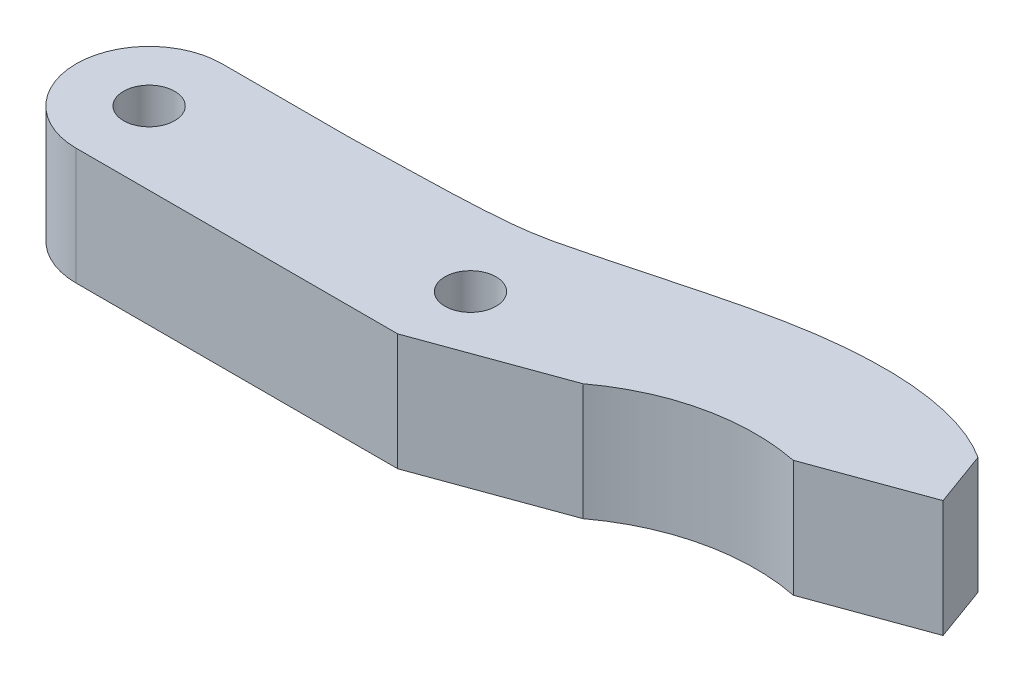
ISO-10303-21;
HEADER;
FILE_DESCRIPTION(('STEP AP214'),'2;1');
FILE_NAME('part.step','',(''),(''),'','','');
FILE_SCHEMA(('AUTOMOTIVE_DESIGN { 1 0 10303 214 1 1 1 1 }'));
ENDSEC;
DATA;
#1=APPLICATION_CONTEXT('core data for automotive mechanical design processes');
#2=APPLICATION_PROTOCOL_DEFINITION('international standard','automotive_design',2000,#1);
#3=PRODUCT_CONTEXT('',#1,'mechanical');
#4=PRODUCT('Part','Part','',(#3));
#5=PRODUCT_RELATED_PRODUCT_CATEGORY('part','',(#4));
#6=PRODUCT_DEFINITION_FORMATION('','',#4);
#7=PRODUCT_DEFINITION_CONTEXT('part definition',#1,'design');
#8=PRODUCT_DEFINITION('design','',#6,#7);
#9=PRODUCT_DEFINITION_SHAPE('','',#8);
#10=(LENGTH_UNIT() NAMED_UNIT(*) SI_UNIT(.MILLI.,.METRE.));
#11=(NAMED_UNIT(*) PLANE_ANGLE_UNIT() SI_UNIT($,.RADIAN.));
#12=(NAMED_UNIT(*) SI_UNIT($,.STERADIAN.) SOLID_ANGLE_UNIT());
#13=UNCERTAINTY_MEASURE_WITH_UNIT(LENGTH_MEASURE(1.E-05),#10,'distance_accuracy_value','');
#14=(GEOMETRIC_REPRESENTATION_CONTEXT(3) GLOBAL_UNCERTAINTY_ASSIGNED_CONTEXT((#13)) GLOBAL_UNIT_ASSIGNED_CONTEXT((#10,
#11,#12)) REPRESENTATION_CONTEXT('',''));
#15=CARTESIAN_POINT('',(0.,0.,0.));
#16=DIRECTION('',(0.,0.,1.));
#17=DIRECTION('',(1.,0.,0.));
#18=AXIS2_PLACEMENT_3D('',#15,#16,#17);
#19=CARTESIAN_POINT('',(0.,8.,0.));
#20=DIRECTION('',(0.,1.,0.));
#21=DIRECTION('',(0.,0.,1.));
#22=AXIS2_PLACEMENT_3D('',#19,#20,#21);
#23=PLANE('',#22);
#24=CARTESIAN_POINT('',(0.,8.,0.));
#25=DIRECTION('',(0.,1.,0.));
#26=DIRECTION('',(0.,0.,1.));
#27=AXIS2_PLACEMENT_3D('',#24,#25,#26);
#28=CIRCLE('',#27,1.75);
#29=CARTESIAN_POINT('',(0.,8.,1.75));
#30=VERTEX_POINT('',#29);
#31=EDGE_CURVE('E192',#30,#30,#28,.T.);
#32=ORIENTED_EDGE('',*,*,#31,.F.);
#33=EDGE_LOOP('',(#32));
#34=FACE_BOUND('',#33,.T.);
#35=CARTESIAN_POINT('',(0.,8.,0.));
#36=DIRECTION('',(0.,1.,0.));
#37=DIRECTION('',(0.,0.,1.));
#38=AXIS2_PLACEMENT_3D('',#35,#36,#37);
#39=CIRCLE('',#38,5.);
#40=CARTESIAN_POINT('',(0.,8.,-5.));
#41=VERTEX_POINT('',#40);
#42=CARTESIAN_POINT('',(0.,8.,5.));
#43=VERTEX_POINT('',#42);
#44=EDGE_CURVE('E198',#41,#43,#39,.T.);
#45=ORIENTED_EDGE('',*,*,#44,.T.);
#46=DIRECTION('',(1.,0.,0.));
#47=VECTOR('',#46,1.);
#48=CARTESIAN_POINT('',(0.,8.,5.));
#49=LINE('',#48,#47);
#50=CARTESIAN_POINT('',(22.0154718075747,8.,5.));
#51=VERTEX_POINT('',#50);
#52=EDGE_CURVE('E93',#43,#51,#49,.T.);
#53=ORIENTED_EDGE('',*,*,#52,.T.);
#54=DIRECTION('',(0.939692620785908,0.,-0.34202014332567));
#55=VECTOR('',#54,1.);
#56=CARTESIAN_POINT('',(22.0154718075747,8.,5.));
#57=LINE('',#56,#55);
#58=CARTESIAN_POINT('',(31.3184287533552,8.,1.61400058107586));
#59=VERTEX_POINT('',#58);
#60=EDGE_CURVE('E201',#51,#59,#57,.T.);
#61=ORIENTED_EDGE('',*,*,#60,.T.);
#62=CARTESIAN_POINT('',(40.1742925465507,8.,13.4719696644037));
#63=DIRECTION('',(0.,-1.,0.));
#64=DIRECTION('',(0.,0.,-1.));
#65=AXIS2_PLACEMENT_3D('',#62,#63,#64);
#66=CIRCLE('',#65,14.7999241317241);
#67=CARTESIAN_POINT('',(43.0521943321293,8.,-1.04544868795335));
#68=VERTEX_POINT('',#67);
#69=EDGE_CURVE('E203',#59,#68,#66,.T.);
#70=ORIENTED_EDGE('',*,*,#69,.T.);
#71=DIRECTION('',(0.939692620785908,0.,-0.34202014332567));
#72=VECTOR('',#71,1.);
#73=CARTESIAN_POINT('',(43.0521943321293,8.,-1.04544868795335));
#74=LINE('',#73,#72);
#75=CARTESIAN_POINT('',(50.5697352984166,8.,-3.78160983455871));
#76=VERTEX_POINT('',#75);
#77=EDGE_CURVE('E112',#68,#76,#74,.T.);
#78=ORIENTED_EDGE('',*,*,#77,.T.);
#79=DIRECTION('',(-0.342020143325669,0.,-0.939692620785908));
#80=VECTOR('',#79,1.);
#81=CARTESIAN_POINT('',(50.5697352984166,8.,-3.78160983455871));
#82=LINE('',#81,#80);
#83=CARTESIAN_POINT('',(49.2016547251139,8.,-7.54038031770234));
#84=VERTEX_POINT('',#83);
#85=EDGE_CURVE('E106',#76,#84,#82,.T.);
#86=ORIENTED_EDGE('',*,*,#85,.T.);
#87=CARTESIAN_POINT('',(49.201654725114,8.,-7.54038031770231));
#88=CARTESIAN_POINT('',(46.2595057479489,8.,-9.44154741661983));
#89=CARTESIAN_POINT('',(40.8783588109812,8.,-10.315839720437));
#90=CARTESIAN_POINT('',(30.5663362877365,8.,-8.16520332360282));
#91=CARTESIAN_POINT('',(26.7015982142515,8.,-6.99026183960731));
#92=CARTESIAN_POINT('',(19.0153320272197,8.,-5.1134109408604));
#93=CARTESIAN_POINT('',(11.831247013395,8.,-5.11325248850904));
#94=CARTESIAN_POINT('',(8.7,8.,-5.));
#95=B_SPLINE_CURVE_WITH_KNOTS('',3,(#87,#88,#89,#90,#91,#92,#93,#94),.UNSPECIFIED.,.F.,.F.,(4,1,
1,1,1,4),(0.,0.522941519191293,0.610638691715125,0.847379165957973,0.889274552714496,1.),.UNSPECIFIED.);
#96=CARTESIAN_POINT('',(8.7,8.,-5.));
#97=VERTEX_POINT('',#96);
#98=EDGE_CURVE('E110',#84,#97,#95,.T.);
#99=ORIENTED_EDGE('',*,*,#98,.T.);
#100=DIRECTION('',(-1.,0.,0.));
#101=VECTOR('',#100,1.);
#102=CARTESIAN_POINT('',(0.,8.,-5.));
#103=LINE('',#102,#101);
#104=EDGE_CURVE('E50',#97,#41,#103,.T.);
#105=ORIENTED_EDGE('',*,*,#104,.T.);
#106=EDGE_LOOP('',(#45,#53,#61,#70,#78,#86,#99,#105));
#107=FACE_BOUND('',#106,.T.);
#108=CARTESIAN_POINT('',(22.,8.,0.));
#109=DIRECTION('',(0.,1.,0.));
#110=DIRECTION('',(0.,0.,1.));
#111=AXIS2_PLACEMENT_3D('',#108,#109,#110);
#112=CIRCLE('',#111,1.75);
#113=CARTESIAN_POINT('',(22.,8.,1.75));
#114=VERTEX_POINT('',#113);
#115=EDGE_CURVE('E183',#114,#114,#112,.T.);
#116=ORIENTED_EDGE('',*,*,#115,.F.);
#117=EDGE_LOOP('',(#116));
#118=FACE_BOUND('',#117,.T.);
#119=ADVANCED_FACE('F33',(#34,#107,#118),#23,.T.);
#120=CARTESIAN_POINT('',(0.,0.,0.));
#121=DIRECTION('',(0.,1.,0.));
#122=DIRECTION('',(0.,0.,1.));
#123=AXIS2_PLACEMENT_3D('',#120,#121,#122);
#124=PLANE('',#123);
#125=CARTESIAN_POINT('',(0.,0.,0.));
#126=DIRECTION('',(0.,1.,0.));
#127=DIRECTION('',(0.,0.,1.));
#128=AXIS2_PLACEMENT_3D('',#125,#126,#127);
#129=CIRCLE('',#128,1.75);
#130=CARTESIAN_POINT('',(0.,0.,1.75));
#131=VERTEX_POINT('',#130);
#132=EDGE_CURVE('E189',#131,#131,#129,.T.);
#133=ORIENTED_EDGE('',*,*,#132,.T.);
#134=EDGE_LOOP('',(#133));
#135=FACE_BOUND('',#134,.T.);
#136=CARTESIAN_POINT('',(0.,0.,0.));
#137=DIRECTION('',(0.,1.,0.));
#138=DIRECTION('',(0.,0.,1.));
#139=AXIS2_PLACEMENT_3D('',#136,#137,#138);
#140=CIRCLE('',#139,5.);
#141=CARTESIAN_POINT('',(0.,0.,-5.));
#142=VERTEX_POINT('',#141);
#143=CARTESIAN_POINT('',(0.,0.,5.));
#144=VERTEX_POINT('',#143);
#145=EDGE_CURVE('E195',#142,#144,#140,.T.);
#146=ORIENTED_EDGE('',*,*,#145,.F.);
#147=DIRECTION('',(-1.,0.,0.));
#148=VECTOR('',#147,1.);
#149=CARTESIAN_POINT('',(0.,0.,-5.));
#150=LINE('',#149,#148);
#151=CARTESIAN_POINT('',(8.7,0.,-5.));
#152=VERTEX_POINT('',#151);
#153=EDGE_CURVE('E85',#152,#142,#150,.T.);
#154=ORIENTED_EDGE('',*,*,#153,.F.);
#155=CARTESIAN_POINT('',(49.201654725114,0.,-7.54038031770231));
#156=CARTESIAN_POINT('',(46.2595057479489,0.,-9.44154741661983));
#157=CARTESIAN_POINT('',(40.8783588109812,0.,-10.315839720437));
#158=CARTESIAN_POINT('',(30.5663362877365,0.,-8.16520332360282));
#159=CARTESIAN_POINT('',(26.7015982142515,0.,-6.99026183960731));
#160=CARTESIAN_POINT('',(19.0153320272197,0.,-5.1134109408604));
#161=CARTESIAN_POINT('',(11.831247013395,0.,-5.11325248850904));
#162=CARTESIAN_POINT('',(8.7,0.,-5.));
#163=B_SPLINE_CURVE_WITH_KNOTS('',3,(#155,#156,#157,#158,#159,#160,#161,#162),.UNSPECIFIED.,.F.,
.F.,(4,1,1,1,1,4),(0.,0.522941519191293,0.610638691715125,0.847379165957973,0.889274552714496,
1.),.UNSPECIFIED.);
#164=CARTESIAN_POINT('',(49.2016547251139,0.,-7.54038031770234));
#165=VERTEX_POINT('',#164);
#166=EDGE_CURVE('E79',#165,#152,#163,.T.);
#167=ORIENTED_EDGE('',*,*,#166,.F.);
#168=DIRECTION('',(-0.342020143325669,0.,-0.939692620785908));
#169=VECTOR('',#168,1.);
#170=CARTESIAN_POINT('',(50.5697352984166,0.,-3.78160983455871));
#171=LINE('',#170,#169);
#172=CARTESIAN_POINT('',(50.5697352984166,0.,-3.78160983455871));
#173=VERTEX_POINT('',#172);
#174=EDGE_CURVE('E120',#173,#165,#171,.T.);
#175=ORIENTED_EDGE('',*,*,#174,.F.);
#176=DIRECTION('',(0.939692620785908,0.,-0.34202014332567));
#177=VECTOR('',#176,1.);
#178=CARTESIAN_POINT('',(43.0521943321293,0.,-1.04544868795335));
#179=LINE('',#178,#177);
#180=CARTESIAN_POINT('',(43.0521943321293,0.,-1.04544868795335));
#181=VERTEX_POINT('',#180);
#182=EDGE_CURVE('E216',#181,#173,#179,.T.);
#183=ORIENTED_EDGE('',*,*,#182,.F.);
#184=CARTESIAN_POINT('',(40.1742925465507,0.,13.4719696644037));
#185=DIRECTION('',(0.,-1.,0.));
#186=DIRECTION('',(0.,0.,-1.));
#187=AXIS2_PLACEMENT_3D('',#184,#185,#186);
#188=CIRCLE('',#187,14.7999241317241);
#189=CARTESIAN_POINT('',(31.3184287533552,0.,1.61400058107586));
#190=VERTEX_POINT('',#189);
#191=EDGE_CURVE('E212',#190,#181,#188,.T.);
#192=ORIENTED_EDGE('',*,*,#191,.F.);
#193=DIRECTION('',(0.939692620785908,0.,-0.34202014332567));
#194=VECTOR('',#193,1.);
#195=CARTESIAN_POINT('',(22.0154718075747,0.,5.));
#196=LINE('',#195,#194);
#197=CARTESIAN_POINT('',(22.0154718075747,0.,5.));
#198=VERTEX_POINT('',#197);
#199=EDGE_CURVE('E222',#198,#190,#196,.T.);
#200=ORIENTED_EDGE('',*,*,#199,.F.);
#201=DIRECTION('',(1.,0.,0.));
#202=VECTOR('',#201,1.);
#203=CARTESIAN_POINT('',(0.,0.,5.));
#204=LINE('',#203,#202);
#205=EDGE_CURVE('E225',#144,#198,#204,.T.);
#206=ORIENTED_EDGE('',*,*,#205,.F.);
#207=EDGE_LOOP('',(#146,#154,#167,#175,#183,#192,#200,#206));
#208=FACE_BOUND('',#207,.T.);
#209=CARTESIAN_POINT('',(22.,0.,0.));
#210=DIRECTION('',(0.,1.,0.));
#211=DIRECTION('',(0.,0.,1.));
#212=AXIS2_PLACEMENT_3D('',#209,#210,#211);
#213=CIRCLE('',#212,1.75);
#214=CARTESIAN_POINT('',(22.,0.,1.75));
#215=VERTEX_POINT('',#214);
#216=EDGE_CURVE('E186',#215,#215,#213,.T.);
#217=ORIENTED_EDGE('',*,*,#216,.T.);
#218=EDGE_LOOP('',(#217));
#219=FACE_BOUND('',#218,.T.);
#220=ADVANCED_FACE('F160',(#135,#208,#219),#124,.F.);
#221=CARTESIAN_POINT('',(0.,8.,0.));
#222=DIRECTION('',(0.,-1.,0.));
#223=DIRECTION('',(0.,0.,-1.));
#224=AXIS2_PLACEMENT_3D('',#221,#222,#223);
#225=CYLINDRICAL_SURFACE('',#224,5.);
#226=ORIENTED_EDGE('',*,*,#145,.T.);
#227=DIRECTION('',(0.,-1.,0.));
#228=VECTOR('',#227,1.);
#229=CARTESIAN_POINT('',(0.,8.,5.));
#230=LINE('',#229,#228);
#231=EDGE_CURVE('E11',#43,#144,#230,.T.);
#232=ORIENTED_EDGE('',*,*,#231,.F.);
#233=ORIENTED_EDGE('',*,*,#44,.F.);
#234=DIRECTION('',(0.,-1.,0.));
#235=VECTOR('',#234,1.);
#236=CARTESIAN_POINT('',(0.,8.,-5.));
#237=LINE('',#236,#235);
#238=EDGE_CURVE('E126',#41,#142,#237,.T.);
#239=ORIENTED_EDGE('',*,*,#238,.T.);
#240=EDGE_LOOP('',(#226,#232,#233,#239));
#241=FACE_BOUND('',#240,.T.);
#242=ADVANCED_FACE('F35',(#241),#225,.T.);
#243=CARTESIAN_POINT('',(0.,8.,5.));
#244=DIRECTION('',(0.,0.,-1.));
#245=DIRECTION('',(-1.,0.,0.));
#246=AXIS2_PLACEMENT_3D('',#243,#244,#245);
#247=PLANE('',#246);
#248=ORIENTED_EDGE('',*,*,#205,.T.);
#249=DIRECTION('',(0.,-1.,0.));
#250=VECTOR('',#249,1.);
#251=CARTESIAN_POINT('',(22.0154718075747,8.,5.));
#252=LINE('',#251,#250);
#253=EDGE_CURVE('E42',#51,#198,#252,.T.);
#254=ORIENTED_EDGE('',*,*,#253,.F.);
#255=ORIENTED_EDGE('',*,*,#52,.F.);
#256=ORIENTED_EDGE('',*,*,#231,.T.);
#257=EDGE_LOOP('',(#248,#254,#255,#256));
#258=FACE_BOUND('',#257,.T.);
#259=ADVANCED_FACE('F154',(#258),#247,.F.);
#260=CARTESIAN_POINT('',(22.0154718075747,8.,5.));
#261=DIRECTION('',(-0.34202014332567,0.,-0.939692620785908));
#262=DIRECTION('',(-0.939692620785908,0.,0.34202014332567));
#263=AXIS2_PLACEMENT_3D('',#260,#261,#262);
#264=PLANE('',#263);
#265=ORIENTED_EDGE('',*,*,#199,.T.);
#266=DIRECTION('',(0.,-1.,0.));
#267=VECTOR('',#266,1.);
#268=CARTESIAN_POINT('',(31.3184287533552,8.,1.61400058107586));
#269=LINE('',#268,#267);
#270=EDGE_CURVE('E214',#59,#190,#269,.T.);
#271=ORIENTED_EDGE('',*,*,#270,.F.);
#272=ORIENTED_EDGE('',*,*,#60,.F.);
#273=ORIENTED_EDGE('',*,*,#253,.T.);
#274=EDGE_LOOP('',(#265,#271,#272,#273));
#275=FACE_BOUND('',#274,.T.);
#276=ADVANCED_FACE('F151',(#275),#264,.F.);
#277=CARTESIAN_POINT('',(40.1742925465507,8.,13.4719696644037));
#278=DIRECTION('',(0.,-1.,0.));
#279=DIRECTION('',(0.,0.,-1.));
#280=AXIS2_PLACEMENT_3D('',#277,#278,#279);
#281=CYLINDRICAL_SURFACE('',#280,14.7999241317241);
#282=ORIENTED_EDGE('',*,*,#191,.T.);
#283=DIRECTION('',(0.,-1.,0.));
#284=VECTOR('',#283,1.);
#285=CARTESIAN_POINT('',(43.0521943321293,8.,-1.04544868795335));
#286=LINE('',#285,#284);
#287=EDGE_CURVE('E210',#68,#181,#286,.T.);
#288=ORIENTED_EDGE('',*,*,#287,.F.);
#289=ORIENTED_EDGE('',*,*,#69,.F.);
#290=ORIENTED_EDGE('',*,*,#270,.T.);
#291=EDGE_LOOP('',(#282,#288,#289,#290));
#292=FACE_BOUND('',#291,.T.);
#293=ADVANCED_FACE('F147',(#292),#281,.F.);
#294=CARTESIAN_POINT('',(43.0521943321293,8.,-1.04544868795335));
#295=DIRECTION('',(-0.34202014332567,0.,-0.939692620785908));
#296=DIRECTION('',(-0.939692620785908,0.,0.34202014332567));
#297=AXIS2_PLACEMENT_3D('',#294,#295,#296);
#298=PLANE('',#297);
#299=ORIENTED_EDGE('',*,*,#182,.T.);
#300=DIRECTION('',(0.,-1.,0.));
#301=VECTOR('',#300,1.);
#302=CARTESIAN_POINT('',(50.5697352984166,8.,-3.78160983455871));
#303=LINE('',#302,#301);
#304=EDGE_CURVE('E121',#76,#173,#303,.T.);
#305=ORIENTED_EDGE('',*,*,#304,.F.);
#306=ORIENTED_EDGE('',*,*,#77,.F.);
#307=ORIENTED_EDGE('',*,*,#287,.T.);
#308=EDGE_LOOP('',(#299,#305,#306,#307));
#309=FACE_BOUND('',#308,.T.);
#310=ADVANCED_FACE('F144',(#309),#298,.F.);
#311=CARTESIAN_POINT('',(50.5697352984166,8.,-3.78160983455871));
#312=DIRECTION('',(-0.939692620785908,0.,0.342020143325669));
#313=DIRECTION('',(0.342020143325669,0.,0.939692620785908));
#314=AXIS2_PLACEMENT_3D('',#311,#312,#313);
#315=PLANE('',#314);
#316=ORIENTED_EDGE('',*,*,#174,.T.);
#317=DIRECTION('',(0.,-1.,0.));
#318=VECTOR('',#317,1.);
#319=CARTESIAN_POINT('',(49.2016547251139,8.,-7.54038031770234));
#320=LINE('',#319,#318);
#321=EDGE_CURVE('E117',#84,#165,#320,.T.);
#322=ORIENTED_EDGE('',*,*,#321,.F.);
#323=ORIENTED_EDGE('',*,*,#85,.F.);
#324=ORIENTED_EDGE('',*,*,#304,.T.);
#325=EDGE_LOOP('',(#316,#322,#323,#324));
#326=FACE_BOUND('',#325,.T.);
#327=ADVANCED_FACE('F118',(#326),#315,.F.);
#328=DIRECTION('',(0.,-1.,0.));
#329=VECTOR('',#328,1.);
#330=SURFACE_OF_LINEAR_EXTRUSION('',#95,#329);
#331=ORIENTED_EDGE('',*,*,#166,.T.);
#332=DIRECTION('',(0.,-1.,0.));
#333=VECTOR('',#332,1.);
#334=CARTESIAN_POINT('',(8.7,8.,-5.));
#335=LINE('',#334,#333);
#336=EDGE_CURVE('E122',#97,#152,#335,.T.);
#337=ORIENTED_EDGE('',*,*,#336,.F.);
#338=ORIENTED_EDGE('',*,*,#98,.F.);
#339=ORIENTED_EDGE('',*,*,#321,.T.);
#340=EDGE_LOOP('',(#331,#337,#338,#339));
#341=FACE_BOUND('',#340,.T.);
#342=ADVANCED_FACE('F124',(#341),#330,.F.);
#343=CARTESIAN_POINT('',(0.,8.,-5.));
#344=DIRECTION('',(0.,0.,1.));
#345=DIRECTION('',(1.,0.,0.));
#346=AXIS2_PLACEMENT_3D('',#343,#344,#345);
#347=PLANE('',#346);
#348=ORIENTED_EDGE('',*,*,#153,.T.);
#349=ORIENTED_EDGE('',*,*,#238,.F.);
#350=ORIENTED_EDGE('',*,*,#104,.F.);
#351=ORIENTED_EDGE('',*,*,#336,.T.);
#352=EDGE_LOOP('',(#348,#349,#350,#351));
#353=FACE_BOUND('',#352,.T.);
#354=ADVANCED_FACE('F140',(#353),#347,.F.);
#355=CARTESIAN_POINT('',(0.,8.,0.));
#356=DIRECTION('',(0.,-1.,0.));
#357=DIRECTION('',(0.,0.,-1.));
#358=AXIS2_PLACEMENT_3D('',#355,#356,#357);
#359=CYLINDRICAL_SURFACE('',#358,1.75);
#360=ORIENTED_EDGE('',*,*,#31,.T.);
#361=EDGE_LOOP('',(#360));
#362=FACE_BOUND('',#361,.T.);
#363=ORIENTED_EDGE('',*,*,#132,.F.);
#364=EDGE_LOOP('',(#363));
#365=FACE_BOUND('',#364,.T.);
#366=ADVANCED_FACE('F171',(#362,#365),#359,.F.);
#367=CARTESIAN_POINT('',(22.,8.,0.));
#368=DIRECTION('',(0.,-1.,0.));
#369=DIRECTION('',(0.,0.,-1.));
#370=AXIS2_PLACEMENT_3D('',#367,#368,#369);
#371=CYLINDRICAL_SURFACE('',#370,1.75);
#372=ORIENTED_EDGE('',*,*,#115,.T.);
#373=EDGE_LOOP('',(#372));
#374=FACE_BOUND('',#373,.T.);
#375=ORIENTED_EDGE('',*,*,#216,.F.);
#376=EDGE_LOOP('',(#375));
#377=FACE_BOUND('',#376,.T.);
#378=ADVANCED_FACE('F174',(#374,#377),#371,.F.);
#379=CLOSED_SHELL('',(#119,#220,#242,#259,#276,#293,#310,#327,#342,#354,#366,#378));
#380=MANIFOLD_SOLID_BREP('B2',#379);
#381=ADVANCED_BREP_SHAPE_REPRESENTATION('',(#18,#380),#14);
#382=SHAPE_DEFINITION_REPRESENTATION(#9,#381);
ENDSEC;
END-ISO-10303-21;
